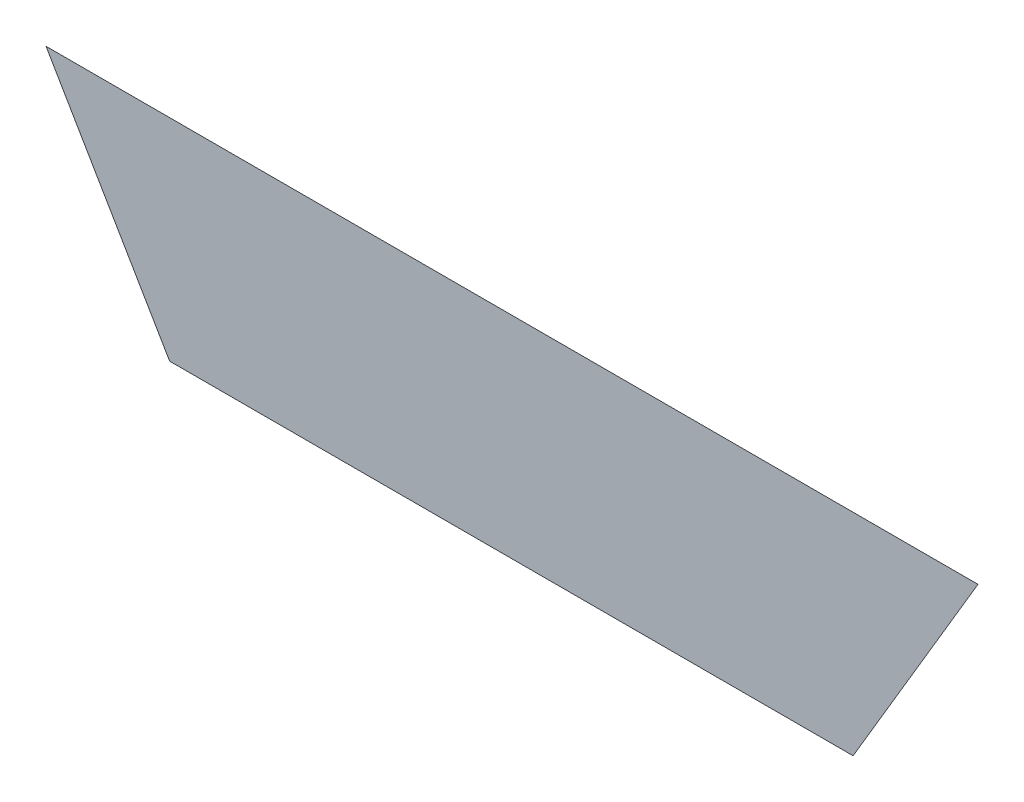
ISO-10303-21;
HEADER;
FILE_DESCRIPTION(('STEP AP214'),'2;1');
FILE_NAME('part.step','',(''),(''),'','','');
FILE_SCHEMA(('AUTOMOTIVE_DESIGN { 1 0 10303 214 1 1 1 1 }'));
ENDSEC;
DATA;
#1=APPLICATION_CONTEXT('core data for automotive mechanical design processes');
#2=APPLICATION_PROTOCOL_DEFINITION('international standard','automotive_design',2000,#1);
#3=PRODUCT_CONTEXT('',#1,'mechanical');
#4=PRODUCT('Part','Part','',(#3));
#5=PRODUCT_RELATED_PRODUCT_CATEGORY('part','',(#4));
#6=PRODUCT_DEFINITION_FORMATION('','',#4);
#7=PRODUCT_DEFINITION_CONTEXT('part definition',#1,'design');
#8=PRODUCT_DEFINITION('design','',#6,#7);
#9=PRODUCT_DEFINITION_SHAPE('','',#8);
#10=(LENGTH_UNIT() NAMED_UNIT(*) SI_UNIT(.MILLI.,.METRE.));
#11=(NAMED_UNIT(*) PLANE_ANGLE_UNIT() SI_UNIT($,.RADIAN.));
#12=(NAMED_UNIT(*) SI_UNIT($,.STERADIAN.) SOLID_ANGLE_UNIT());
#13=UNCERTAINTY_MEASURE_WITH_UNIT(LENGTH_MEASURE(1.E-05),#10,'distance_accuracy_value','');
#14=(GEOMETRIC_REPRESENTATION_CONTEXT(3) GLOBAL_UNCERTAINTY_ASSIGNED_CONTEXT((#13)) GLOBAL_UNIT_ASSIGNED_CONTEXT((#10,
#11,#12)) REPRESENTATION_CONTEXT('',''));
#15=CARTESIAN_POINT('',(0.,0.,0.));
#16=DIRECTION('',(0.,0.,1.));
#17=DIRECTION('',(1.,0.,0.));
#18=AXIS2_PLACEMENT_3D('',#15,#16,#17);
#19=CARTESIAN_POINT('',(-0.045141828774,0.863549475847,0.00045));
#20=DIRECTION('',(0.,0.,1.));
#21=DIRECTION('',(1.,0.,0.));
#22=AXIS2_PLACEMENT_3D('',#19,#20,#21);
#23=PLANE('',#22);
#24=CARTESIAN_POINT('',(0.115519930801,0.863549475847,0.00045));
#25=DIRECTION('',(0.509570899852276,0.860428671084211,0.));
#26=VECTOR('',#25,1.);
#27=LINE('',#24,#26);
#28=CARTESIAN_POINT('',(0.115519930801,0.863549475847,0.000225));
#29=VERTEX_POINT('',#28);
#30=CARTESIAN_POINT('',(0.174357075001,0.962898096047,0.000225));
#31=VERTEX_POINT('',#30);
#32=EDGE_CURVE('E41',#29,#31,#27,.T.);
#33=ORIENTED_EDGE('',*,*,#32,.T.);
#34=CARTESIAN_POINT('',(0.174357075001,0.962898096047,0.00045));
#35=DIRECTION('',(-1.,0.,0.));
#36=VECTOR('',#35,1.);
#37=LINE('',#34,#36);
#38=CARTESIAN_POINT('',(-0.264640732549,0.962898096047,0.000225));
#39=VERTEX_POINT('',#38);
#40=EDGE_CURVE('E28',#31,#39,#37,.T.);
#41=ORIENTED_EDGE('',*,*,#40,.T.);
#42=CARTESIAN_POINT('',(-0.264640732549,0.962898096047,0.00045));
#43=DIRECTION('',(0.505626052511722,-0.862752742691331,0.));
#44=VECTOR('',#43,1.);
#45=LINE('',#42,#44);
#46=CARTESIAN_POINT('',(-0.206416344299,0.863549475847,0.000225));
#47=VERTEX_POINT('',#46);
#48=EDGE_CURVE('E11',#39,#47,#45,.T.);
#49=ORIENTED_EDGE('',*,*,#48,.T.);
#50=CARTESIAN_POINT('',(-0.206416344299,0.863549475847,0.00045));
#51=DIRECTION('',(1.,0.,0.));
#52=VECTOR('',#51,1.);
#53=LINE('',#50,#52);
#54=EDGE_CURVE('E44',#47,#29,#53,.T.);
#55=ORIENTED_EDGE('',*,*,#54,.T.);
#56=EDGE_LOOP('',(#33,#41,#49,#55));
#57=FACE_BOUND('',#56,.T.);
#58=ADVANCED_FACE('F17',(#57),#23,.T.);
#59=CARTESIAN_POINT('',(-0.045141828774,0.863549475847,0.));
#60=DIRECTION('',(0.,0.,1.));
#61=DIRECTION('',(1.,0.,0.));
#62=AXIS2_PLACEMENT_3D('',#59,#60,#61);
#63=PLANE('',#62);
#64=ORIENTED_EDGE('',*,*,#40,.F.);
#65=ORIENTED_EDGE('',*,*,#32,.F.);
#66=ORIENTED_EDGE('',*,*,#54,.F.);
#67=ORIENTED_EDGE('',*,*,#48,.F.);
#68=EDGE_LOOP('',(#64,#65,#66,#67));
#69=FACE_BOUND('',#68,.T.);
#70=ADVANCED_FACE('F46',(#69),#63,.F.);
#71=CLOSED_SHELL('',(#58,#70));
#72=MANIFOLD_SOLID_BREP('B1',#71);
#73=ADVANCED_BREP_SHAPE_REPRESENTATION('',(#18,#72),#14);
#74=SHAPE_DEFINITION_REPRESENTATION(#9,#73);
ENDSEC;
END-ISO-10303-21;
